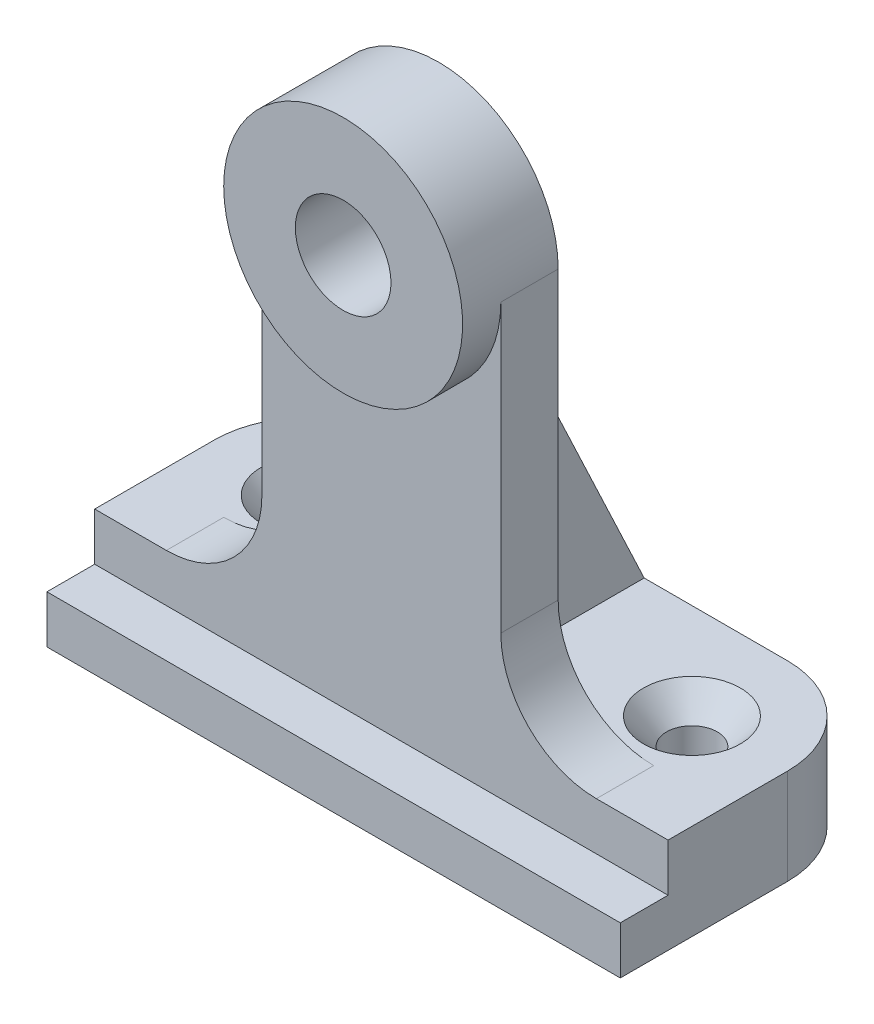
ISO-10303-21;
HEADER;
FILE_DESCRIPTION(('STEP AP214'),'2;1');
FILE_NAME('part.step','',(''),(''),'','','');
FILE_SCHEMA(('AUTOMOTIVE_DESIGN { 1 0 10303 214 1 1 1 1 }'));
ENDSEC;
DATA;
#1=APPLICATION_CONTEXT('core data for automotive mechanical design processes');
#2=APPLICATION_PROTOCOL_DEFINITION('international standard','automotive_design',2000,#1);
#3=PRODUCT_CONTEXT('',#1,'mechanical');
#4=PRODUCT('Part','Part','',(#3));
#5=PRODUCT_RELATED_PRODUCT_CATEGORY('part','',(#4));
#6=PRODUCT_DEFINITION_FORMATION('','',#4);
#7=PRODUCT_DEFINITION_CONTEXT('part definition',#1,'design');
#8=PRODUCT_DEFINITION('design','',#6,#7);
#9=PRODUCT_DEFINITION_SHAPE('','',#8);
#10=(LENGTH_UNIT() NAMED_UNIT(*) SI_UNIT(.MILLI.,.METRE.));
#11=(NAMED_UNIT(*) PLANE_ANGLE_UNIT() SI_UNIT($,.RADIAN.));
#12=(NAMED_UNIT(*) SI_UNIT($,.STERADIAN.) SOLID_ANGLE_UNIT());
#13=UNCERTAINTY_MEASURE_WITH_UNIT(LENGTH_MEASURE(1.E-05),#10,'distance_accuracy_value','');
#14=(GEOMETRIC_REPRESENTATION_CONTEXT(3) GLOBAL_UNCERTAINTY_ASSIGNED_CONTEXT((#13)) GLOBAL_UNIT_ASSIGNED_CONTEXT((#10,
#11,#12)) REPRESENTATION_CONTEXT('',''));
#15=CARTESIAN_POINT('',(0.,0.,0.));
#16=DIRECTION('',(0.,0.,1.));
#17=DIRECTION('',(1.,0.,0.));
#18=AXIS2_PLACEMENT_3D('',#15,#16,#17);
#19=CARTESIAN_POINT('',(25.4,12.7,-4.7625));
#20=DIRECTION('',(0.,-1.,0.));
#21=DIRECTION('',(0.,0.,-1.));
#22=AXIS2_PLACEMENT_3D('',#19,#20,#21);
#23=PLANE('',#22);
#24=CARTESIAN_POINT('',(-25.4,12.7,-4.7625));
#25=DIRECTION('',(0.,1.,0.));
#26=DIRECTION('',(0.,0.,1.));
#27=AXIS2_PLACEMENT_3D('',#24,#25,#26);
#28=CIRCLE('',#27,6.4389);
#29=CARTESIAN_POINT('',(-25.4,12.7,1.6764));
#30=VERTEX_POINT('',#29);
#31=EDGE_CURVE('E217',#30,#30,#28,.T.);
#32=ORIENTED_EDGE('',*,*,#31,.F.);
#33=EDGE_LOOP('',(#32));
#34=FACE_BOUND('',#33,.T.);
#35=DIRECTION('',(0.,0.,-1.));
#36=VECTOR('',#35,1.);
#37=CARTESIAN_POINT('',(-6.35,12.7,3.4925));
#38=LINE('',#37,#36);
#39=CARTESIAN_POINT('',(-6.35,12.7,3.4925));
#40=VERTEX_POINT('',#39);
#41=CARTESIAN_POINT('',(-6.35,12.7,-17.4625));
#42=VERTEX_POINT('',#41);
#43=EDGE_CURVE('E53',#40,#42,#38,.T.);
#44=ORIENTED_EDGE('',*,*,#43,.T.);
#45=DIRECTION('',(-1.,0.,0.));
#46=VECTOR('',#45,1.);
#47=CARTESIAN_POINT('',(-25.4,12.7,-17.4625));
#48=LINE('',#47,#46);
#49=CARTESIAN_POINT('',(-25.4,12.7,-17.4625));
#50=VERTEX_POINT('',#49);
#51=EDGE_CURVE('E261',#42,#50,#48,.T.);
#52=ORIENTED_EDGE('',*,*,#51,.T.);
#53=CARTESIAN_POINT('',(-25.4,12.7,-4.7625));
#54=DIRECTION('',(0.,1.,0.));
#55=DIRECTION('',(0.,0.,1.));
#56=AXIS2_PLACEMENT_3D('',#53,#54,#55);
#57=CIRCLE('',#56,12.7);
#58=CARTESIAN_POINT('',(-38.1,12.7,-4.7625));
#59=VERTEX_POINT('',#58);
#60=EDGE_CURVE('E265',#50,#59,#57,.T.);
#61=ORIENTED_EDGE('',*,*,#60,.T.);
#62=DIRECTION('',(0.,0.,1.));
#63=VECTOR('',#62,1.);
#64=CARTESIAN_POINT('',(-38.1,12.7,-4.76249999999999));
#65=LINE('',#64,#63);
#66=CARTESIAN_POINT('',(-38.1,12.7,11.1125));
#67=VERTEX_POINT('',#66);
#68=EDGE_CURVE('E267',#59,#67,#65,.T.);
#69=ORIENTED_EDGE('',*,*,#68,.T.);
#70=DIRECTION('',(1.,0.,0.));
#71=VECTOR('',#70,1.);
#72=CARTESIAN_POINT('',(-38.1,12.7,11.1125));
#73=LINE('',#72,#71);
#74=CARTESIAN_POINT('',(-28.575,12.7,11.1125));
#75=VERTEX_POINT('',#74);
#76=EDGE_CURVE('E270',#67,#75,#73,.T.);
#77=ORIENTED_EDGE('',*,*,#76,.T.);
#78=DIRECTION('',(0.,0.,1.));
#79=VECTOR('',#78,1.);
#80=CARTESIAN_POINT('',(-28.575,12.7,-4.7625));
#81=LINE('',#80,#79);
#82=CARTESIAN_POINT('',(-28.575,12.7,3.4925));
#83=VERTEX_POINT('',#82);
#84=EDGE_CURVE('E301',#75,#83,#81,.F.);
#85=ORIENTED_EDGE('',*,*,#84,.T.);
#86=DIRECTION('',(1.,0.,0.));
#87=VECTOR('',#86,1.);
#88=CARTESIAN_POINT('',(-15.875,12.7,3.4925));
#89=LINE('',#88,#87);
#90=EDGE_CURVE('E203',#83,#40,#89,.T.);
#91=ORIENTED_EDGE('',*,*,#90,.T.);
#92=EDGE_LOOP('',(#44,#52,#61,#69,#77,#85,#91));
#93=FACE_BOUND('',#92,.T.);
#94=ADVANCED_FACE('F38',(#34,#93),#23,.F.);
#95=CARTESIAN_POINT('',(25.4,12.7,-4.7625));
#96=DIRECTION('',(0.,1.,0.));
#97=DIRECTION('',(0.,0.,1.));
#98=AXIS2_PLACEMENT_3D('',#95,#96,#97);
#99=CIRCLE('',#98,6.4389);
#100=CARTESIAN_POINT('',(25.4,12.7,1.6764));
#101=VERTEX_POINT('',#100);
#102=EDGE_CURVE('E228',#101,#101,#99,.T.);
#103=ORIENTED_EDGE('',*,*,#102,.F.);
#104=EDGE_LOOP('',(#103));
#105=FACE_BOUND('',#104,.T.);
#106=CARTESIAN_POINT('',(25.4,12.7,-17.4625));
#107=VERTEX_POINT('',#106);
#108=CARTESIAN_POINT('',(6.35,12.7,-17.4625));
#109=VERTEX_POINT('',#108);
#110=EDGE_CURVE('E263',#107,#109,#48,.T.);
#111=ORIENTED_EDGE('',*,*,#110,.T.);
#112=DIRECTION('',(0.,0.,-1.));
#113=VECTOR('',#112,1.);
#114=CARTESIAN_POINT('',(6.35,12.7,3.4925));
#115=LINE('',#114,#113);
#116=CARTESIAN_POINT('',(6.35,12.7,3.4925));
#117=VERTEX_POINT('',#116);
#118=EDGE_CURVE('E552',#117,#109,#115,.T.);
#119=ORIENTED_EDGE('',*,*,#118,.F.);
#120=CARTESIAN_POINT('',(28.575,12.7,3.4925));
#121=VERTEX_POINT('',#120);
#122=EDGE_CURVE('E201',#117,#121,#89,.T.);
#123=ORIENTED_EDGE('',*,*,#122,.T.);
#124=DIRECTION('',(0.,0.,1.));
#125=VECTOR('',#124,1.);
#126=CARTESIAN_POINT('',(28.575,12.7,-4.7625));
#127=LINE('',#126,#125);
#128=CARTESIAN_POINT('',(28.575,12.7,11.1125));
#129=VERTEX_POINT('',#128);
#130=EDGE_CURVE('E304',#121,#129,#127,.T.);
#131=ORIENTED_EDGE('',*,*,#130,.T.);
#132=CARTESIAN_POINT('',(38.1,12.7,11.1125));
#133=VERTEX_POINT('',#132);
#134=EDGE_CURVE('E269',#129,#133,#73,.T.);
#135=ORIENTED_EDGE('',*,*,#134,.T.);
#136=DIRECTION('',(0.,0.,-1.));
#137=VECTOR('',#136,1.);
#138=CARTESIAN_POINT('',(38.1,12.7,-4.7625));
#139=LINE('',#138,#137);
#140=CARTESIAN_POINT('',(38.1,12.7,-4.7625));
#141=VERTEX_POINT('',#140);
#142=EDGE_CURVE('E273',#133,#141,#139,.T.);
#143=ORIENTED_EDGE('',*,*,#142,.T.);
#144=CARTESIAN_POINT('',(25.4,12.7,-4.7625));
#145=DIRECTION('',(0.,1.,0.));
#146=DIRECTION('',(0.,0.,-1.));
#147=AXIS2_PLACEMENT_3D('',#144,#145,#146);
#148=CIRCLE('',#147,12.7);
#149=EDGE_CURVE('E258',#141,#107,#148,.T.);
#150=ORIENTED_EDGE('',*,*,#149,.T.);
#151=EDGE_LOOP('',(#111,#119,#123,#131,#135,#143,#150));
#152=FACE_BOUND('',#151,.T.);
#153=ADVANCED_FACE('F342',(#105,#152),#23,.F.);
#154=CARTESIAN_POINT('',(-38.1,12.7,11.1125));
#155=DIRECTION('',(0.,0.,-1.));
#156=DIRECTION('',(-1.,0.,0.));
#157=AXIS2_PLACEMENT_3D('',#154,#155,#156);
#158=PLANE('',#157);
#159=DIRECTION('',(-1.,0.,0.));
#160=VECTOR('',#159,1.);
#161=CARTESIAN_POINT('',(-38.1,6.35,11.1125));
#162=LINE('',#161,#160);
#163=CARTESIAN_POINT('',(38.1,6.35,11.1125));
#164=VERTEX_POINT('',#163);
#165=CARTESIAN_POINT('',(-38.1,6.35,11.1125));
#166=VERTEX_POINT('',#165);
#167=EDGE_CURVE('E246',#164,#166,#162,.T.);
#168=ORIENTED_EDGE('',*,*,#167,.F.);
#169=DIRECTION('',(0.,-1.,0.));
#170=VECTOR('',#169,1.);
#171=CARTESIAN_POINT('',(38.1,12.7,11.1125));
#172=LINE('',#171,#170);
#173=EDGE_CURVE('E287',#133,#164,#172,.T.);
#174=ORIENTED_EDGE('',*,*,#173,.F.);
#175=ORIENTED_EDGE('',*,*,#134,.F.);
#176=CARTESIAN_POINT('',(28.575,25.4,11.1125));
#177=DIRECTION('',(0.,0.,-1.));
#178=DIRECTION('',(-1.,0.,0.));
#179=AXIS2_PLACEMENT_3D('',#176,#177,#178);
#180=CIRCLE('',#179,12.7);
#181=CARTESIAN_POINT('',(15.875,25.4,11.1125));
#182=VERTEX_POINT('',#181);
#183=EDGE_CURVE('E312',#129,#182,#180,.T.);
#184=ORIENTED_EDGE('',*,*,#183,.T.);
#185=DIRECTION('',(0.,1.,0.));
#186=VECTOR('',#185,1.);
#187=CARTESIAN_POINT('',(15.875,12.7,11.1125));
#188=LINE('',#187,#186);
#189=CARTESIAN_POINT('',(15.875,63.5,11.1125));
#190=VERTEX_POINT('',#189);
#191=EDGE_CURVE('E210',#182,#190,#188,.T.);
#192=ORIENTED_EDGE('',*,*,#191,.T.);
#193=CARTESIAN_POINT('',(0.,63.5,11.1125));
#194=DIRECTION('',(0.,0.,-1.));
#195=DIRECTION('',(1.,0.,0.));
#196=AXIS2_PLACEMENT_3D('',#193,#194,#195);
#197=CIRCLE('',#196,15.875);
#198=CARTESIAN_POINT('',(-15.875,63.5,11.1125));
#199=VERTEX_POINT('',#198);
#200=EDGE_CURVE('E202',#190,#199,#197,.T.);
#201=ORIENTED_EDGE('',*,*,#200,.T.);
#202=DIRECTION('',(0.,-1.,0.));
#203=VECTOR('',#202,1.);
#204=CARTESIAN_POINT('',(-15.875,12.7,11.1125));
#205=LINE('',#204,#203);
#206=CARTESIAN_POINT('',(-15.875,25.4,11.1125));
#207=VERTEX_POINT('',#206);
#208=EDGE_CURVE('E195',#199,#207,#205,.T.);
#209=ORIENTED_EDGE('',*,*,#208,.T.);
#210=CARTESIAN_POINT('',(-28.575,25.4,11.1125));
#211=DIRECTION('',(0.,0.,-1.));
#212=DIRECTION('',(-1.,0.,0.));
#213=AXIS2_PLACEMENT_3D('',#210,#211,#212);
#214=CIRCLE('',#213,12.7);
#215=EDGE_CURVE('E46',#207,#75,#214,.T.);
#216=ORIENTED_EDGE('',*,*,#215,.T.);
#217=ORIENTED_EDGE('',*,*,#76,.F.);
#218=DIRECTION('',(0.,-1.,0.));
#219=VECTOR('',#218,1.);
#220=CARTESIAN_POINT('',(-38.1,12.7,11.1125));
#221=LINE('',#220,#219);
#222=EDGE_CURVE('E290',#67,#166,#221,.T.);
#223=ORIENTED_EDGE('',*,*,#222,.T.);
#224=EDGE_LOOP('',(#168,#174,#175,#184,#192,#201,#209,#216,#217,#223));
#225=FACE_BOUND('',#224,.T.);
#226=ADVANCED_FACE('F318',(#225),#158,.F.);
#227=CARTESIAN_POINT('',(25.4,12.7,-4.7625));
#228=DIRECTION('',(0.,-1.,0.));
#229=DIRECTION('',(0.,0.,-1.));
#230=AXIS2_PLACEMENT_3D('',#227,#228,#229);
#231=CYLINDRICAL_SURFACE('',#230,12.7);
#232=CARTESIAN_POINT('',(25.4,0.,-4.7625));
#233=DIRECTION('',(0.,1.,0.));
#234=DIRECTION('',(0.,0.,-1.));
#235=AXIS2_PLACEMENT_3D('',#232,#233,#234);
#236=CIRCLE('',#235,12.7);
#237=CARTESIAN_POINT('',(38.1,0.,-4.7625));
#238=VERTEX_POINT('',#237);
#239=CARTESIAN_POINT('',(25.4,0.,-17.4625));
#240=VERTEX_POINT('',#239);
#241=EDGE_CURVE('E257',#238,#240,#236,.T.);
#242=ORIENTED_EDGE('',*,*,#241,.T.);
#243=DIRECTION('',(0.,-1.,0.));
#244=VECTOR('',#243,1.);
#245=CARTESIAN_POINT('',(25.4,12.7,-17.4625));
#246=LINE('',#245,#244);
#247=EDGE_CURVE('E298',#107,#240,#246,.T.);
#248=ORIENTED_EDGE('',*,*,#247,.F.);
#249=ORIENTED_EDGE('',*,*,#149,.F.);
#250=DIRECTION('',(0.,-1.,0.));
#251=VECTOR('',#250,1.);
#252=CARTESIAN_POINT('',(38.1,12.7,-4.7625));
#253=LINE('',#252,#251);
#254=EDGE_CURVE('E275',#141,#238,#253,.T.);
#255=ORIENTED_EDGE('',*,*,#254,.T.);
#256=EDGE_LOOP('',(#242,#248,#249,#255));
#257=FACE_BOUND('',#256,.T.);
#258=ADVANCED_FACE('F354',(#257),#231,.T.);
#259=CARTESIAN_POINT('',(-25.4,12.7,-17.4625));
#260=DIRECTION('',(0.,0.,1.));
#261=DIRECTION('',(1.,0.,0.));
#262=AXIS2_PLACEMENT_3D('',#259,#260,#261);
#263=PLANE('',#262);
#264=DIRECTION('',(-1.,0.,0.));
#265=VECTOR('',#264,1.);
#266=CARTESIAN_POINT('',(-25.4,0.,-17.4625));
#267=LINE('',#266,#265);
#268=CARTESIAN_POINT('',(-25.4,0.,-17.4625));
#269=VERTEX_POINT('',#268);
#270=EDGE_CURVE('E278',#240,#269,#267,.T.);
#271=ORIENTED_EDGE('',*,*,#270,.T.);
#272=DIRECTION('',(0.,-1.,0.));
#273=VECTOR('',#272,1.);
#274=CARTESIAN_POINT('',(-25.4,12.7,-17.4625));
#275=LINE('',#274,#273);
#276=EDGE_CURVE('E295',#50,#269,#275,.T.);
#277=ORIENTED_EDGE('',*,*,#276,.F.);
#278=ORIENTED_EDGE('',*,*,#51,.F.);
#279=DIRECTION('',(-1.,0.,0.));
#280=VECTOR('',#279,1.);
#281=CARTESIAN_POINT('',(6.35,12.7,-17.4625));
#282=LINE('',#281,#280);
#283=EDGE_CURVE('E60',#109,#42,#282,.T.);
#284=ORIENTED_EDGE('',*,*,#283,.F.);
#285=ORIENTED_EDGE('',*,*,#110,.F.);
#286=ORIENTED_EDGE('',*,*,#247,.T.);
#287=EDGE_LOOP('',(#271,#277,#278,#284,#285,#286));
#288=FACE_BOUND('',#287,.T.);
#289=ADVANCED_FACE('F356',(#288),#263,.F.);
#290=CARTESIAN_POINT('',(-25.4,12.7,-4.7625));
#291=DIRECTION('',(0.,-1.,0.));
#292=DIRECTION('',(0.,0.,-1.));
#293=AXIS2_PLACEMENT_3D('',#290,#291,#292);
#294=CYLINDRICAL_SURFACE('',#293,12.7);
#295=CARTESIAN_POINT('',(-25.4,0.,-4.7625));
#296=DIRECTION('',(0.,1.,0.));
#297=DIRECTION('',(0.,0.,1.));
#298=AXIS2_PLACEMENT_3D('',#295,#296,#297);
#299=CIRCLE('',#298,12.7);
#300=CARTESIAN_POINT('',(-38.1,0.,-4.7625));
#301=VERTEX_POINT('',#300);
#302=EDGE_CURVE('E280',#269,#301,#299,.T.);
#303=ORIENTED_EDGE('',*,*,#302,.T.);
#304=DIRECTION('',(0.,-1.,0.));
#305=VECTOR('',#304,1.);
#306=CARTESIAN_POINT('',(-38.1,12.7,-4.7625));
#307=LINE('',#306,#305);
#308=EDGE_CURVE('E292',#59,#301,#307,.T.);
#309=ORIENTED_EDGE('',*,*,#308,.F.);
#310=ORIENTED_EDGE('',*,*,#60,.F.);
#311=ORIENTED_EDGE('',*,*,#276,.T.);
#312=EDGE_LOOP('',(#303,#309,#310,#311));
#313=FACE_BOUND('',#312,.T.);
#314=ADVANCED_FACE('F362',(#313),#294,.T.);
#315=CARTESIAN_POINT('',(-38.1,12.7,-4.76249999999999));
#316=DIRECTION('',(1.,0.,0.));
#317=DIRECTION('',(0.,0.,-1.));
#318=AXIS2_PLACEMENT_3D('',#315,#316,#317);
#319=PLANE('',#318);
#320=DIRECTION('',(0.,0.,1.));
#321=VECTOR('',#320,1.);
#322=CARTESIAN_POINT('',(-38.1,0.,-4.76249999999999));
#323=LINE('',#322,#321);
#324=CARTESIAN_POINT('',(-38.1,0.,17.4625));
#325=VERTEX_POINT('',#324);
#326=EDGE_CURVE('E282',#301,#325,#323,.T.);
#327=ORIENTED_EDGE('',*,*,#326,.T.);
#328=DIRECTION('',(0.,-1.,0.));
#329=VECTOR('',#328,1.);
#330=CARTESIAN_POINT('',(-38.1,6.35,17.4625));
#331=LINE('',#330,#329);
#332=CARTESIAN_POINT('',(-38.1,6.35,17.4625));
#333=VERTEX_POINT('',#332);
#334=EDGE_CURVE('E254',#333,#325,#331,.T.);
#335=ORIENTED_EDGE('',*,*,#334,.F.);
#336=DIRECTION('',(0.,0.,1.));
#337=VECTOR('',#336,1.);
#338=CARTESIAN_POINT('',(-38.1,6.35,11.1125));
#339=LINE('',#338,#337);
#340=EDGE_CURVE('E238',#166,#333,#339,.T.);
#341=ORIENTED_EDGE('',*,*,#340,.F.);
#342=ORIENTED_EDGE('',*,*,#222,.F.);
#343=ORIENTED_EDGE('',*,*,#68,.F.);
#344=ORIENTED_EDGE('',*,*,#308,.T.);
#345=EDGE_LOOP('',(#327,#335,#341,#342,#343,#344));
#346=FACE_BOUND('',#345,.T.);
#347=ADVANCED_FACE('F369',(#346),#319,.F.);
#348=CARTESIAN_POINT('',(38.1,12.7,-4.7625));
#349=DIRECTION('',(-1.,0.,0.));
#350=DIRECTION('',(0.,0.,1.));
#351=AXIS2_PLACEMENT_3D('',#348,#349,#350);
#352=PLANE('',#351);
#353=DIRECTION('',(0.,0.,-1.));
#354=VECTOR('',#353,1.);
#355=CARTESIAN_POINT('',(38.1,0.,-4.7625));
#356=LINE('',#355,#354);
#357=CARTESIAN_POINT('',(38.1,0.,17.4625));
#358=VERTEX_POINT('',#357);
#359=EDGE_CURVE('E262',#358,#238,#356,.T.);
#360=ORIENTED_EDGE('',*,*,#359,.T.);
#361=ORIENTED_EDGE('',*,*,#254,.F.);
#362=ORIENTED_EDGE('',*,*,#142,.F.);
#363=ORIENTED_EDGE('',*,*,#173,.T.);
#364=DIRECTION('',(0.,0.,-1.));
#365=VECTOR('',#364,1.);
#366=CARTESIAN_POINT('',(38.1,6.35,11.1125));
#367=LINE('',#366,#365);
#368=CARTESIAN_POINT('',(38.1,6.35,17.4625));
#369=VERTEX_POINT('',#368);
#370=EDGE_CURVE('E243',#369,#164,#367,.T.);
#371=ORIENTED_EDGE('',*,*,#370,.F.);
#372=DIRECTION('',(0.,-1.,0.));
#373=VECTOR('',#372,1.);
#374=CARTESIAN_POINT('',(38.1,6.35,17.4625));
#375=LINE('',#374,#373);
#376=EDGE_CURVE('E249',#369,#358,#375,.T.);
#377=ORIENTED_EDGE('',*,*,#376,.T.);
#378=EDGE_LOOP('',(#360,#361,#362,#363,#371,#377));
#379=FACE_BOUND('',#378,.T.);
#380=ADVANCED_FACE('F349',(#379),#352,.F.);
#381=CARTESIAN_POINT('',(25.4,0.,-4.7625));
#382=DIRECTION('',(0.,-1.,0.));
#383=DIRECTION('',(0.,0.,-1.));
#384=AXIS2_PLACEMENT_3D('',#381,#382,#383);
#385=PLANE('',#384);
#386=CARTESIAN_POINT('',(-25.4,0.,-4.7625));
#387=DIRECTION('',(0.,1.,0.));
#388=DIRECTION('',(0.,0.,1.));
#389=AXIS2_PLACEMENT_3D('',#386,#387,#388);
#390=CIRCLE('',#389,3.3782);
#391=CARTESIAN_POINT('',(-25.4,0.,-1.3843));
#392=VERTEX_POINT('',#391);
#393=EDGE_CURVE('E225',#392,#392,#390,.T.);
#394=ORIENTED_EDGE('',*,*,#393,.T.);
#395=EDGE_LOOP('',(#394));
#396=FACE_BOUND('',#395,.T.);
#397=CARTESIAN_POINT('',(25.4,0.,-4.7625));
#398=DIRECTION('',(0.,1.,0.));
#399=DIRECTION('',(0.,0.,1.));
#400=AXIS2_PLACEMENT_3D('',#397,#398,#399);
#401=CIRCLE('',#400,3.3782);
#402=CARTESIAN_POINT('',(25.4,0.,-1.3843));
#403=VERTEX_POINT('',#402);
#404=EDGE_CURVE('E234',#403,#403,#401,.T.);
#405=ORIENTED_EDGE('',*,*,#404,.T.);
#406=EDGE_LOOP('',(#405));
#407=FACE_BOUND('',#406,.T.);
#408=ORIENTED_EDGE('',*,*,#241,.F.);
#409=ORIENTED_EDGE('',*,*,#359,.F.);
#410=DIRECTION('',(1.,0.,0.));
#411=VECTOR('',#410,1.);
#412=CARTESIAN_POINT('',(-38.1,0.,17.4625));
#413=LINE('',#412,#411);
#414=EDGE_CURVE('E237',#325,#358,#413,.T.);
#415=ORIENTED_EDGE('',*,*,#414,.F.);
#416=ORIENTED_EDGE('',*,*,#326,.F.);
#417=ORIENTED_EDGE('',*,*,#302,.F.);
#418=ORIENTED_EDGE('',*,*,#270,.F.);
#419=EDGE_LOOP('',(#408,#409,#415,#416,#417,#418));
#420=FACE_BOUND('',#419,.T.);
#421=ADVANCED_FACE('F365',(#396,#407,#420),#385,.T.);
#422=CARTESIAN_POINT('',(-38.1,6.35,17.4625));
#423=DIRECTION('',(0.,0.,-1.));
#424=DIRECTION('',(-1.,0.,0.));
#425=AXIS2_PLACEMENT_3D('',#422,#423,#424);
#426=PLANE('',#425);
#427=ORIENTED_EDGE('',*,*,#414,.T.);
#428=ORIENTED_EDGE('',*,*,#376,.F.);
#429=DIRECTION('',(1.,0.,0.));
#430=VECTOR('',#429,1.);
#431=CARTESIAN_POINT('',(-38.1,6.35,17.4625));
#432=LINE('',#431,#430);
#433=EDGE_CURVE('E241',#333,#369,#432,.T.);
#434=ORIENTED_EDGE('',*,*,#433,.F.);
#435=ORIENTED_EDGE('',*,*,#334,.T.);
#436=EDGE_LOOP('',(#427,#428,#434,#435));
#437=FACE_BOUND('',#436,.T.);
#438=ADVANCED_FACE('F375',(#437),#426,.F.);
#439=CARTESIAN_POINT('',(0.,6.35,0.));
#440=DIRECTION('',(0.,1.,0.));
#441=DIRECTION('',(0.,0.,1.));
#442=AXIS2_PLACEMENT_3D('',#439,#440,#441);
#443=PLANE('',#442);
#444=ORIENTED_EDGE('',*,*,#340,.T.);
#445=ORIENTED_EDGE('',*,*,#433,.T.);
#446=ORIENTED_EDGE('',*,*,#370,.T.);
#447=ORIENTED_EDGE('',*,*,#167,.T.);
#448=EDGE_LOOP('',(#444,#445,#446,#447));
#449=FACE_BOUND('',#448,.T.);
#450=ADVANCED_FACE('F372',(#449),#443,.T.);
#451=CARTESIAN_POINT('',(25.4,12.7,-4.7625));
#452=DIRECTION('',(0.,1.,0.));
#453=DIRECTION('',(0.,0.,1.));
#454=AXIS2_PLACEMENT_3D('',#451,#452,#453);
#455=CYLINDRICAL_SURFACE('',#454,3.3782);
#456=ORIENTED_EDGE('',*,*,#404,.F.);
#457=EDGE_LOOP('',(#456));
#458=FACE_BOUND('',#457,.T.);
#459=CARTESIAN_POINT('',(25.4,9.17906741601865,-4.7625));
#460=DIRECTION('',(0.,1.,0.));
#461=DIRECTION('',(0.,0.,1.));
#462=AXIS2_PLACEMENT_3D('',#459,#460,#461);
#463=CIRCLE('',#462,3.3782);
#464=CARTESIAN_POINT('',(25.4,9.17906741601865,-1.3843));
#465=VERTEX_POINT('',#464);
#466=EDGE_CURVE('E231',#465,#465,#463,.T.);
#467=ORIENTED_EDGE('',*,*,#466,.T.);
#468=EDGE_LOOP('',(#467));
#469=FACE_BOUND('',#468,.T.);
#470=ADVANCED_FACE('F382',(#458,#469),#455,.F.);
#471=CARTESIAN_POINT('',(25.4,12.7,-4.7625));
#472=DIRECTION('',(0.,1.,0.));
#473=DIRECTION('',(0.,0.,1.));
#474=AXIS2_PLACEMENT_3D('',#471,#472,#473);
#475=CONICAL_SURFACE('',#474,6.4389,0.715584993317675);
#476=ORIENTED_EDGE('',*,*,#466,.F.);
#477=EDGE_LOOP('',(#476));
#478=FACE_BOUND('',#477,.T.);
#479=ORIENTED_EDGE('',*,*,#102,.T.);
#480=EDGE_LOOP('',(#479));
#481=FACE_BOUND('',#480,.T.);
#482=ADVANCED_FACE('F429',(#478,#481),#475,.F.);
#483=CARTESIAN_POINT('',(-25.4,12.7,-4.7625));
#484=DIRECTION('',(0.,1.,0.));
#485=DIRECTION('',(0.,0.,1.));
#486=AXIS2_PLACEMENT_3D('',#483,#484,#485);
#487=CYLINDRICAL_SURFACE('',#486,3.3782);
#488=ORIENTED_EDGE('',*,*,#393,.F.);
#489=EDGE_LOOP('',(#488));
#490=FACE_BOUND('',#489,.T.);
#491=CARTESIAN_POINT('',(-25.4,9.17906741601865,-4.7625));
#492=DIRECTION('',(0.,1.,0.));
#493=DIRECTION('',(0.,0.,1.));
#494=AXIS2_PLACEMENT_3D('',#491,#492,#493);
#495=CIRCLE('',#494,3.3782);
#496=CARTESIAN_POINT('',(-25.4,9.17906741601865,-1.3843));
#497=VERTEX_POINT('',#496);
#498=EDGE_CURVE('E222',#497,#497,#495,.T.);
#499=ORIENTED_EDGE('',*,*,#498,.T.);
#500=EDGE_LOOP('',(#499));
#501=FACE_BOUND('',#500,.T.);
#502=ADVANCED_FACE('F425',(#490,#501),#487,.F.);
#503=CARTESIAN_POINT('',(-25.4,12.7,-4.7625));
#504=DIRECTION('',(0.,1.,0.));
#505=DIRECTION('',(0.,0.,1.));
#506=AXIS2_PLACEMENT_3D('',#503,#504,#505);
#507=CONICAL_SURFACE('',#506,6.4389,0.715584993317675);
#508=ORIENTED_EDGE('',*,*,#498,.F.);
#509=EDGE_LOOP('',(#508));
#510=FACE_BOUND('',#509,.T.);
#511=ORIENTED_EDGE('',*,*,#31,.T.);
#512=EDGE_LOOP('',(#511));
#513=FACE_BOUND('',#512,.T.);
#514=ADVANCED_FACE('F422',(#510,#513),#507,.F.);
#515=CARTESIAN_POINT('',(-15.875,12.7,3.4925));
#516=DIRECTION('',(-1.,0.,0.));
#517=DIRECTION('',(0.,0.,1.));
#518=AXIS2_PLACEMENT_3D('',#515,#516,#517);
#519=PLANE('',#518);
#520=DIRECTION('',(0.,-1.,0.));
#521=VECTOR('',#520,1.);
#522=CARTESIAN_POINT('',(-15.875,12.7,3.4925));
#523=LINE('',#522,#521);
#524=CARTESIAN_POINT('',(-15.875,63.5,3.4925));
#525=VERTEX_POINT('',#524);
#526=CARTESIAN_POINT('',(-15.875,25.4,3.4925));
#527=VERTEX_POINT('',#526);
#528=EDGE_CURVE('E198',#525,#527,#523,.T.);
#529=ORIENTED_EDGE('',*,*,#528,.T.);
#530=DIRECTION('',(0.,0.,1.));
#531=VECTOR('',#530,1.);
#532=CARTESIAN_POINT('',(-15.875,25.4,3.4925));
#533=LINE('',#532,#531);
#534=EDGE_CURVE('E309',#527,#207,#533,.T.);
#535=ORIENTED_EDGE('',*,*,#534,.T.);
#536=ORIENTED_EDGE('',*,*,#208,.F.);
#537=DIRECTION('',(0.,0.,1.));
#538=VECTOR('',#537,1.);
#539=CARTESIAN_POINT('',(-15.875,63.5,3.4925));
#540=LINE('',#539,#538);
#541=EDGE_CURVE('E214',#525,#199,#540,.T.);
#542=ORIENTED_EDGE('',*,*,#541,.F.);
#543=EDGE_LOOP('',(#529,#535,#536,#542));
#544=FACE_BOUND('',#543,.T.);
#545=ADVANCED_FACE('F327',(#544),#519,.T.);
#546=CARTESIAN_POINT('',(15.875,12.7,3.4925));
#547=DIRECTION('',(1.,0.,0.));
#548=DIRECTION('',(0.,0.,-1.));
#549=AXIS2_PLACEMENT_3D('',#546,#547,#548);
#550=PLANE('',#549);
#551=ORIENTED_EDGE('',*,*,#191,.F.);
#552=DIRECTION('',(0.,0.,1.));
#553=VECTOR('',#552,1.);
#554=CARTESIAN_POINT('',(15.875,25.4,3.4925));
#555=LINE('',#554,#553);
#556=CARTESIAN_POINT('',(15.875,25.4,3.4925));
#557=VERTEX_POINT('',#556);
#558=EDGE_CURVE('E307',#182,#557,#555,.F.);
#559=ORIENTED_EDGE('',*,*,#558,.T.);
#560=DIRECTION('',(0.,1.,0.));
#561=VECTOR('',#560,1.);
#562=CARTESIAN_POINT('',(15.875,12.7,3.4925));
#563=LINE('',#562,#561);
#564=CARTESIAN_POINT('',(15.875,63.5,3.4925));
#565=VERTEX_POINT('',#564);
#566=EDGE_CURVE('E205',#557,#565,#563,.T.);
#567=ORIENTED_EDGE('',*,*,#566,.T.);
#568=DIRECTION('',(0.,0.,1.));
#569=VECTOR('',#568,1.);
#570=CARTESIAN_POINT('',(15.875,63.5,3.4925));
#571=LINE('',#570,#569);
#572=EDGE_CURVE('E207',#565,#190,#571,.T.);
#573=ORIENTED_EDGE('',*,*,#572,.T.);
#574=EDGE_LOOP('',(#551,#559,#567,#573));
#575=FACE_BOUND('',#574,.T.);
#576=ADVANCED_FACE('F411',(#575),#550,.T.);
#577=CARTESIAN_POINT('',(0.,63.5,3.4925));
#578=DIRECTION('',(0.,0.,1.));
#579=DIRECTION('',(1.,0.,0.));
#580=AXIS2_PLACEMENT_3D('',#577,#578,#579);
#581=PLANE('',#580);
#582=ORIENTED_EDGE('',*,*,#122,.F.);
#583=DIRECTION('',(0.,-1.,0.));
#584=VECTOR('',#583,1.);
#585=CARTESIAN_POINT('',(6.35,57.15,3.4925));
#586=LINE('',#585,#584);
#587=CARTESIAN_POINT('',(6.35,57.15,3.4925));
#588=VERTEX_POINT('',#587);
#589=EDGE_CURVE('E178',#588,#117,#586,.T.);
#590=ORIENTED_EDGE('',*,*,#589,.F.);
#591=DIRECTION('',(-1.,0.,0.));
#592=VECTOR('',#591,1.);
#593=CARTESIAN_POINT('',(6.35,57.15,3.4925));
#594=LINE('',#593,#592);
#595=CARTESIAN_POINT('',(0.,57.15,3.4925));
#596=VERTEX_POINT('',#595);
#597=EDGE_CURVE('E170',#588,#596,#594,.T.);
#598=ORIENTED_EDGE('',*,*,#597,.T.);
#599=CARTESIAN_POINT('',(0.,63.5,3.4925));
#600=DIRECTION('',(0.,0.,-1.));
#601=DIRECTION('',(-1.,0.,0.));
#602=AXIS2_PLACEMENT_3D('',#599,#600,#601);
#603=CIRCLE('',#602,6.35);
#604=EDGE_CURVE('E167',#596,#596,#603,.T.);
#605=ORIENTED_EDGE('',*,*,#604,.F.);
#606=CARTESIAN_POINT('',(-6.35,57.15,3.4925));
#607=VERTEX_POINT('',#606);
#608=EDGE_CURVE('E160',#596,#607,#594,.T.);
#609=ORIENTED_EDGE('',*,*,#608,.T.);
#610=DIRECTION('',(0.,-1.,0.));
#611=VECTOR('',#610,1.);
#612=CARTESIAN_POINT('',(-6.35,57.15,3.4925));
#613=LINE('',#612,#611);
#614=EDGE_CURVE('E165',#607,#40,#613,.T.);
#615=ORIENTED_EDGE('',*,*,#614,.T.);
#616=ORIENTED_EDGE('',*,*,#90,.F.);
#617=CARTESIAN_POINT('',(-28.575,25.4,3.4925));
#618=DIRECTION('',(0.,0.,1.));
#619=DIRECTION('',(1.,0.,0.));
#620=AXIS2_PLACEMENT_3D('',#617,#618,#619);
#621=CIRCLE('',#620,12.7);
#622=EDGE_CURVE('E11',#83,#527,#621,.T.);
#623=ORIENTED_EDGE('',*,*,#622,.T.);
#624=ORIENTED_EDGE('',*,*,#528,.F.);
#625=CARTESIAN_POINT('',(0.,63.5,3.4925));
#626=DIRECTION('',(0.,0.,-1.));
#627=DIRECTION('',(-1.,0.,0.));
#628=AXIS2_PLACEMENT_3D('',#625,#626,#627);
#629=CIRCLE('',#628,15.875);
#630=EDGE_CURVE('E190',#525,#565,#629,.T.);
#631=ORIENTED_EDGE('',*,*,#630,.T.);
#632=ORIENTED_EDGE('',*,*,#566,.F.);
#633=CARTESIAN_POINT('',(28.575,25.4,3.4925));
#634=DIRECTION('',(0.,0.,1.));
#635=DIRECTION('',(1.,0.,0.));
#636=AXIS2_PLACEMENT_3D('',#633,#634,#635);
#637=CIRCLE('',#636,12.7);
#638=EDGE_CURVE('E314',#557,#121,#637,.T.);
#639=ORIENTED_EDGE('',*,*,#638,.T.);
#640=EDGE_LOOP('',(#582,#590,#598,#605,#609,#615,#616,#623,#624,#631,#632,#639));
#641=FACE_BOUND('',#640,.T.);
#642=ADVANCED_FACE('F163',(#641),#581,.F.);
#643=CARTESIAN_POINT('',(28.575,25.4,-4.7625));
#644=DIRECTION('',(0.,0.,1.));
#645=DIRECTION('',(1.,0.,0.));
#646=AXIS2_PLACEMENT_3D('',#643,#644,#645);
#647=CYLINDRICAL_SURFACE('',#646,12.7);
#648=ORIENTED_EDGE('',*,*,#638,.F.);
#649=ORIENTED_EDGE('',*,*,#558,.F.);
#650=ORIENTED_EDGE('',*,*,#183,.F.);
#651=ORIENTED_EDGE('',*,*,#130,.F.);
#652=EDGE_LOOP('',(#648,#649,#650,#651));
#653=FACE_BOUND('',#652,.T.);
#654=ADVANCED_FACE('F339',(#653),#647,.F.);
#655=CARTESIAN_POINT('',(-28.575,25.4,3.4925));
#656=DIRECTION('',(0.,0.,1.));
#657=DIRECTION('',(1.,0.,0.));
#658=AXIS2_PLACEMENT_3D('',#655,#656,#657);
#659=CYLINDRICAL_SURFACE('',#658,12.7);
#660=ORIENTED_EDGE('',*,*,#622,.F.);
#661=ORIENTED_EDGE('',*,*,#84,.F.);
#662=ORIENTED_EDGE('',*,*,#215,.F.);
#663=ORIENTED_EDGE('',*,*,#534,.F.);
#664=EDGE_LOOP('',(#660,#661,#662,#663));
#665=FACE_BOUND('',#664,.T.);
#666=ADVANCED_FACE('F40',(#665),#659,.F.);
#667=CARTESIAN_POINT('',(0.,63.5,16.1925));
#668=DIRECTION('',(0.,0.,-1.));
#669=DIRECTION('',(-1.,0.,0.));
#670=AXIS2_PLACEMENT_3D('',#667,#668,#669);
#671=CYLINDRICAL_SURFACE('',#670,15.875);
#672=CARTESIAN_POINT('',(0.,63.5,16.1925));
#673=DIRECTION('',(0.,0.,-1.));
#674=DIRECTION('',(-1.,0.,0.));
#675=AXIS2_PLACEMENT_3D('',#672,#673,#674);
#676=CIRCLE('',#675,15.875);
#677=CARTESIAN_POINT('',(-15.875,63.5,16.1925));
#678=VERTEX_POINT('',#677);
#679=EDGE_CURVE('E192',#678,#678,#676,.T.);
#680=ORIENTED_EDGE('',*,*,#679,.T.);
#681=EDGE_LOOP('',(#680));
#682=FACE_BOUND('',#681,.T.);
#683=ORIENTED_EDGE('',*,*,#541,.T.);
#684=ORIENTED_EDGE('',*,*,#200,.F.);
#685=ORIENTED_EDGE('',*,*,#572,.F.);
#686=ORIENTED_EDGE('',*,*,#630,.F.);
#687=EDGE_LOOP('',(#683,#684,#685,#686));
#688=FACE_BOUND('',#687,.T.);
#689=ADVANCED_FACE('F332',(#682,#688),#671,.T.);
#690=CARTESIAN_POINT('',(0.,63.5,16.1925));
#691=DIRECTION('',(0.,0.,-1.));
#692=DIRECTION('',(-1.,0.,0.));
#693=AXIS2_PLACEMENT_3D('',#690,#691,#692);
#694=PLANE('',#693);
#695=CARTESIAN_POINT('',(0.,63.5,16.1925));
#696=DIRECTION('',(0.,0.,-1.));
#697=DIRECTION('',(-1.,0.,0.));
#698=AXIS2_PLACEMENT_3D('',#695,#696,#697);
#699=CIRCLE('',#698,6.35);
#700=CARTESIAN_POINT('',(-6.35,63.5,16.1925));
#701=VERTEX_POINT('',#700);
#702=EDGE_CURVE('E187',#701,#701,#699,.T.);
#703=ORIENTED_EDGE('',*,*,#702,.T.);
#704=EDGE_LOOP('',(#703));
#705=FACE_BOUND('',#704,.T.);
#706=ORIENTED_EDGE('',*,*,#679,.F.);
#707=EDGE_LOOP('',(#706));
#708=FACE_BOUND('',#707,.T.);
#709=ADVANCED_FACE('F478',(#705,#708),#694,.F.);
#710=CARTESIAN_POINT('',(0.,63.5,16.1925));
#711=DIRECTION('',(0.,0.,-1.));
#712=DIRECTION('',(-1.,0.,0.));
#713=AXIS2_PLACEMENT_3D('',#710,#711,#712);
#714=CYLINDRICAL_SURFACE('',#713,6.35);
#715=ORIENTED_EDGE('',*,*,#702,.F.);
#716=EDGE_LOOP('',(#715));
#717=FACE_BOUND('',#716,.T.);
#718=ORIENTED_EDGE('',*,*,#604,.T.);
#719=EDGE_LOOP('',(#718));
#720=FACE_BOUND('',#719,.T.);
#721=ADVANCED_FACE('F487',(#717,#720),#714,.F.);
#722=CARTESIAN_POINT('',(6.35,57.15,3.4925));
#723=DIRECTION('',(0.,-0.426419231698256,0.9045256429963));
#724=DIRECTION('',(0.,-0.9045256429963,-0.426419231698256));
#725=AXIS2_PLACEMENT_3D('',#722,#723,#724);
#726=PLANE('',#725);
#727=DIRECTION('',(0.,0.9045256429963,0.426419231698256));
#728=VECTOR('',#727,1.);
#729=CARTESIAN_POINT('',(-6.35,57.15,3.4925));
#730=LINE('',#729,#728);
#731=EDGE_CURVE('E174',#42,#607,#730,.T.);
#732=ORIENTED_EDGE('',*,*,#731,.T.);
#733=ORIENTED_EDGE('',*,*,#608,.F.);
#734=ORIENTED_EDGE('',*,*,#597,.F.);
#735=DIRECTION('',(0.,0.9045256429963,0.426419231698256));
#736=VECTOR('',#735,1.);
#737=CARTESIAN_POINT('',(6.35,57.15,3.4925));
#738=LINE('',#737,#736);
#739=EDGE_CURVE('E171',#109,#588,#738,.T.);
#740=ORIENTED_EDGE('',*,*,#739,.F.);
#741=ORIENTED_EDGE('',*,*,#283,.T.);
#742=EDGE_LOOP('',(#732,#733,#734,#740,#741));
#743=FACE_BOUND('',#742,.T.);
#744=ADVANCED_FACE('F175',(#743),#726,.F.);
#745=CARTESIAN_POINT('',(6.35,0.,0.));
#746=DIRECTION('',(1.,0.,0.));
#747=DIRECTION('',(0.,0.,-1.));
#748=AXIS2_PLACEMENT_3D('',#745,#746,#747);
#749=PLANE('',#748);
#750=ORIENTED_EDGE('',*,*,#589,.T.);
#751=ORIENTED_EDGE('',*,*,#118,.T.);
#752=ORIENTED_EDGE('',*,*,#739,.T.);
#753=EDGE_LOOP('',(#750,#751,#752));
#754=FACE_BOUND('',#753,.T.);
#755=ADVANCED_FACE('F529',(#754),#749,.T.);
#756=CARTESIAN_POINT('',(-6.35,0.,0.));
#757=DIRECTION('',(1.,0.,0.));
#758=DIRECTION('',(0.,0.,-1.));
#759=AXIS2_PLACEMENT_3D('',#756,#757,#758);
#760=PLANE('',#759);
#761=ORIENTED_EDGE('',*,*,#614,.F.);
#762=ORIENTED_EDGE('',*,*,#731,.F.);
#763=ORIENTED_EDGE('',*,*,#43,.F.);
#764=EDGE_LOOP('',(#761,#762,#763));
#765=FACE_BOUND('',#764,.T.);
#766=ADVANCED_FACE('F180',(#765),#760,.F.);
#767=CLOSED_SHELL('',(#94,#153,#226,#258,#289,#314,#347,#380,#421,#438,#450,#470,#482,#502,#514,
#545,#576,#642,#654,#666,#689,#709,#721,#744,#755,#766));
#768=MANIFOLD_SOLID_BREP('B2',#767);
#769=ADVANCED_BREP_SHAPE_REPRESENTATION('',(#18,#768),#14);
#770=SHAPE_DEFINITION_REPRESENTATION(#9,#769);
ENDSEC;
END-ISO-10303-21;
